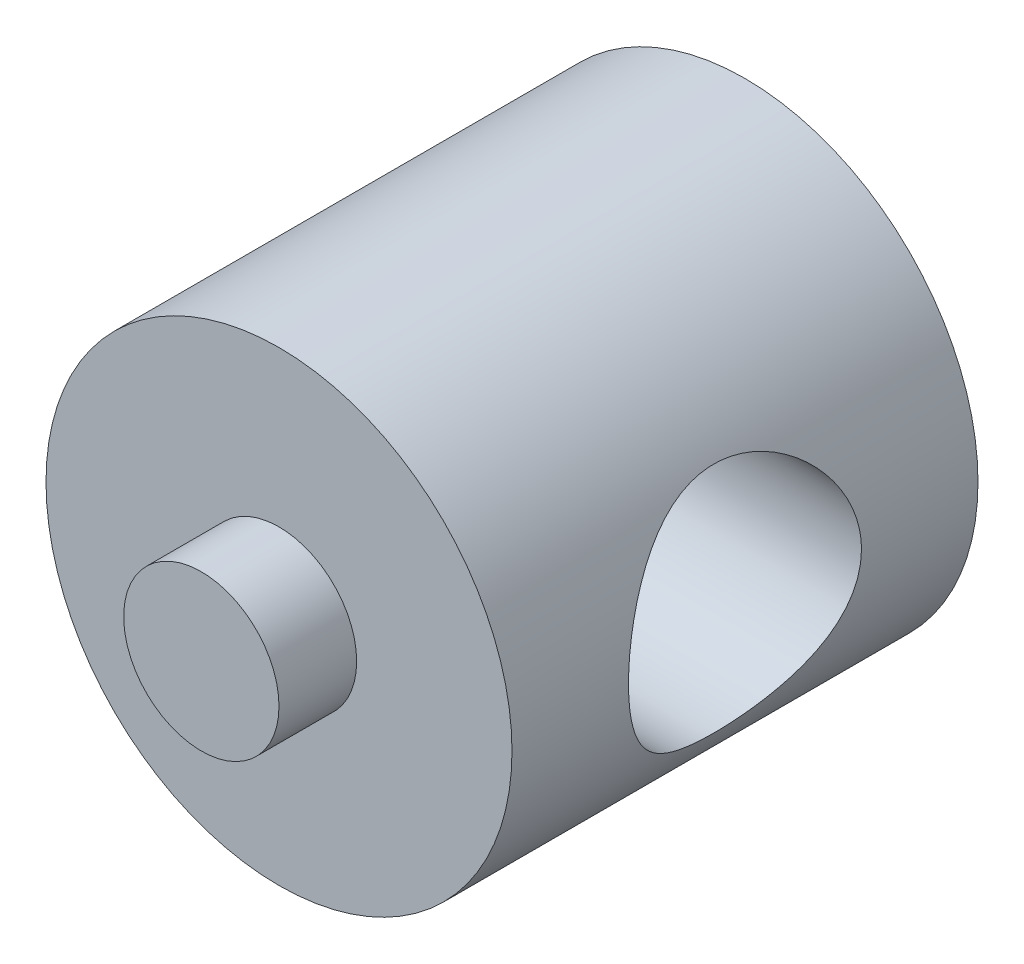
ISO-10303-21;
HEADER;
FILE_DESCRIPTION(('STEP AP214'),'2;1');
FILE_NAME('part.step','',(''),(''),'','','');
FILE_SCHEMA(('AUTOMOTIVE_DESIGN { 1 0 10303 214 1 1 1 1 }'));
ENDSEC;
DATA;
#1=APPLICATION_CONTEXT('core data for automotive mechanical design processes');
#2=APPLICATION_PROTOCOL_DEFINITION('international standard','automotive_design',2000,#1);
#3=PRODUCT_CONTEXT('',#1,'mechanical');
#4=PRODUCT('Part','Part','',(#3));
#5=PRODUCT_RELATED_PRODUCT_CATEGORY('part','',(#4));
#6=PRODUCT_DEFINITION_FORMATION('','',#4);
#7=PRODUCT_DEFINITION_CONTEXT('part definition',#1,'design');
#8=PRODUCT_DEFINITION('design','',#6,#7);
#9=PRODUCT_DEFINITION_SHAPE('','',#8);
#10=(LENGTH_UNIT() NAMED_UNIT(*) SI_UNIT(.MILLI.,.METRE.));
#11=(NAMED_UNIT(*) PLANE_ANGLE_UNIT() SI_UNIT($,.RADIAN.));
#12=(NAMED_UNIT(*) SI_UNIT($,.STERADIAN.) SOLID_ANGLE_UNIT());
#13=UNCERTAINTY_MEASURE_WITH_UNIT(LENGTH_MEASURE(1.E-05),#10,'distance_accuracy_value','');
#14=(GEOMETRIC_REPRESENTATION_CONTEXT(3) GLOBAL_UNCERTAINTY_ASSIGNED_CONTEXT((#13)) GLOBAL_UNIT_ASSIGNED_CONTEXT((#10,
#11,#12)) REPRESENTATION_CONTEXT('',''));
#15=CARTESIAN_POINT('',(0.,0.,0.));
#16=DIRECTION('',(0.,0.,1.));
#17=DIRECTION('',(1.,0.,0.));
#18=AXIS2_PLACEMENT_3D('',#15,#16,#17);
#19=CARTESIAN_POINT('',(0.,0.,9.525));
#20=DIRECTION('',(0.,0.,-1.));
#21=DIRECTION('',(-1.,0.,0.));
#22=AXIS2_PLACEMENT_3D('',#19,#20,#21);
#23=CYLINDRICAL_SURFACE('',#22,9.525);
#24=CARTESIAN_POINT('',(-9.525,0.,-4.7625));
#25=CARTESIAN_POINT('',(-9.5249996206372,0.125243167799989,-4.76249958831423));
#26=CARTESIAN_POINT('',(-9.52252400598023,0.250495089131835,-4.75755388154092));
#27=CARTESIAN_POINT('',(-9.51268396387997,0.500076393496525,-4.73782749335829));
#28=CARTESIAN_POINT('',(-9.50531740964971,0.624405351393145,-4.72304253341983));
#29=CARTESIAN_POINT('',(-9.48587193787975,0.871331001268147,-4.68378465754782));
#30=CARTESIAN_POINT('',(-9.47378630044847,0.993924963523297,-4.65929792572799));
#31=CARTESIAN_POINT('',(-9.44520637539277,1.23637011508467,-4.60090773438337));
#32=CARTESIAN_POINT('',(-9.42871028557932,1.35622016139572,-4.56700042522137));
#33=CARTESIAN_POINT('',(-9.39179697222459,1.59183120722171,-4.49029599546492));
#34=CARTESIAN_POINT('',(-9.37139708461428,1.70760770137533,-4.44753811225714));
#35=CARTESIAN_POINT('',(-9.3271126718355,1.93495086483045,-4.35345002008972));
#36=CARTESIAN_POINT('',(-9.30322683559748,2.04651593025,-4.30211658479887));
#37=CARTESIAN_POINT('',(-9.22716144615755,2.37384489745524,-4.13594585342937));
#38=CARTESIAN_POINT('',(-9.17053150857179,2.58250225923313,-4.00885268845467));
#39=CARTESIAN_POINT('',(-9.04666081910159,2.9885453858336,-3.7170309696508));
#40=CARTESIAN_POINT('',(-8.97898540114139,3.18448556312959,-3.55049071765087));
#41=CARTESIAN_POINT('',(-8.84205954293001,3.5469969745544,-3.18840889326789));
#42=CARTESIAN_POINT('',(-8.77280794740667,3.71354582861883,-2.99284542792684));
#43=CARTESIAN_POINT('',(-8.63435408613187,4.02553537328567,-2.5598674226152));
#44=CARTESIAN_POINT('',(-8.56557212539103,4.16833749963762,-2.32038345074362));
#45=CARTESIAN_POINT('',(-8.47379640254792,4.35029005345507,-1.94317806162735));
#46=CARTESIAN_POINT('',(-8.44509626519091,4.40557901885787,-1.81439982504697));
#47=CARTESIAN_POINT('',(-8.39256904955604,4.50483773649694,-1.55162131087768));
#48=CARTESIAN_POINT('',(-8.36873908777994,4.54881419057647,-1.4176241795386));
#49=CARTESIAN_POINT('',(-8.32818911059645,4.62261399582858,-1.15348439070287));
#50=CARTESIAN_POINT('',(-8.31113119648639,4.65312214328153,-1.0235845780924));
#51=CARTESIAN_POINT('',(-8.28290506375683,4.7031837839128,-0.76111831285817));
#52=CARTESIAN_POINT('',(-8.27173372047612,4.72274308921002,-0.62855331382261));
#53=CARTESIAN_POINT('',(-8.25575723957705,4.75061653464239,-0.36194274554475));
#54=CARTESIAN_POINT('',(-8.25094826797976,4.75893744712047,-0.227898117086417));
#55=CARTESIAN_POINT('',(-8.24790017307781,4.76421854927812,0.0404818193190367));
#56=CARTESIAN_POINT('',(-8.24966042295241,4.76117982286953,0.174817098310511));
#57=CARTESIAN_POINT('',(-8.25906842780931,4.74483797280581,0.426439463053397));
#58=CARTESIAN_POINT('',(-8.26598467895691,4.73280973448218,0.543838732731229));
#59=CARTESIAN_POINT('',(-8.28459407928507,4.7001560114978,0.777063325744908));
#60=CARTESIAN_POINT('',(-8.29628872876442,4.67952782662532,0.89288814292927));
#61=CARTESIAN_POINT('',(-8.33800444414718,4.60506661909892,1.23679640510272));
#62=CARTESIAN_POINT('',(-8.37466460391199,4.5386452957775,1.46148677858525));
#63=CARTESIAN_POINT('',(-8.46236620531704,4.37297035741612,1.90136422745735));
#64=CARTESIAN_POINT('',(-8.51372273880604,4.27298801966147,2.11620803502557));
#65=CARTESIAN_POINT('',(-8.62505005190895,4.04355977442936,2.52713750391294));
#66=CARTESIAN_POINT('',(-8.68502469635285,3.91410063264098,2.72321468317278));
#67=CARTESIAN_POINT('',(-8.8160120789406,3.61029947812718,3.11715493103464));
#68=CARTESIAN_POINT('',(-8.88746017331488,3.43234782914613,3.31209202014425));
#69=CARTESIAN_POINT('',(-9.02721381532401,3.04584295330871,3.67064878147008));
#70=CARTESIAN_POINT('',(-9.0955178493011,2.83727518509305,3.83425348656057));
#71=CARTESIAN_POINT('',(-9.19195370403877,2.49965137796343,4.05616532663717));
#72=CARTESIAN_POINT('',(-9.22372787983903,2.38002127368373,4.12751797031745));
#73=CARTESIAN_POINT('',(-9.28366556941997,2.13427687141611,4.25977821368204));
#74=CARTESIAN_POINT('',(-9.31183060399966,2.00816533613017,4.32069021646027));
#75=CARTESIAN_POINT('',(-9.36371844925579,1.75034069526616,4.43140995548221));
#76=CARTESIAN_POINT('',(-9.38744304755807,1.61862987016266,4.48122216181515));
#77=CARTESIAN_POINT('',(-9.42974072645533,1.35056106639509,4.56916623782169));
#78=CARTESIAN_POINT('',(-9.4483143996453,1.21420362433566,4.60729945117316));
#79=CARTESIAN_POINT('',(-9.47841891468132,0.949450109300047,4.66871072091767));
#80=CARTESIAN_POINT('',(-9.49040564136936,0.821329961906901,4.69295751387122));
#81=CARTESIAN_POINT('',(-9.50921741531494,0.563164063018347,4.73088465881512));
#82=CARTESIAN_POINT('',(-9.51604291885924,0.433118482780759,4.74456594486943));
#83=CARTESIAN_POINT('',(-9.52433687415141,0.172222200636558,4.76117903695803));
#84=CARTESIAN_POINT('',(-9.52580737679104,0.0413718261918288,4.76411495832146));
#85=CARTESIAN_POINT('',(-9.52335444060485,-0.220072847166308,4.75920856581017));
#86=CARTESIAN_POINT('',(-9.51943124049279,-0.350667157156418,4.75136672893597));
#87=CARTESIAN_POINT('',(-9.50681651861088,-0.600383632816324,4.72603956317407));
#88=CARTESIAN_POINT('',(-9.49851975936574,-0.71960779805965,4.70935204534436));
#89=CARTESIAN_POINT('',(-9.47763434053446,-0.956123558476324,4.66708381392194));
#90=CARTESIAN_POINT('',(-9.46504432155854,-1.07341452918894,4.64150028350313));
#91=CARTESIAN_POINT('',(-9.43586934009923,-1.30523272581462,4.58171294409776));
#92=CARTESIAN_POINT('',(-9.41928560017321,-1.41976078572846,4.54751177299423));
#93=CARTESIAN_POINT('',(-9.382499981618,-1.64542419391326,4.47081767633952));
#94=CARTESIAN_POINT('',(-9.36229671724176,-1.75655822362735,4.42832157448654));
#95=CARTESIAN_POINT('',(-9.29566539786795,-2.09007412634844,4.2862997139752));
#96=CARTESIAN_POINT('',(-9.24405921515466,-2.3061103310862,4.17391144344975));
#97=CARTESIAN_POINT('',(-9.13180205397676,-2.7168591855057,3.91901153595821));
#98=CARTESIAN_POINT('',(-9.07114722574502,-2.91156269769227,3.77648706665232));
#99=CARTESIAN_POINT('',(-8.93960783885979,-3.29452731372962,3.44920510528762));
#100=CARTESIAN_POINT('',(-8.868303631423,-3.48027815582499,3.26167471385581));
#101=CARTESIAN_POINT('',(-8.72786114875584,-3.81886460963264,2.85781381337991));
#102=CARTESIAN_POINT('',(-8.65872439991558,-3.97167745144758,2.64146354739159));
#103=CARTESIAN_POINT('',(-8.56092960704944,-4.17638881115549,2.29315273566664));
#104=CARTESIAN_POINT('',(-8.52864647367417,-4.24173741059432,2.16993704199734));
#105=CARTESIAN_POINT('',(-8.46793790675362,-4.36167001930206,1.91748336900804));
#106=CARTESIAN_POINT('',(-8.43951072775552,-4.41625890421415,1.78824815034194));
#107=CARTESIAN_POINT('',(-8.38762286815761,-4.51403084118841,1.52468862385271));
#108=CARTESIAN_POINT('',(-8.36415813189979,-4.55722321448887,1.39036857839809));
#109=CARTESIAN_POINT('',(-8.32316235190995,-4.63167416627274,1.11757678170936));
#110=CARTESIAN_POINT('',(-8.30563038948562,-4.66293459251874,0.979105676886768));
#111=CARTESIAN_POINT('',(-8.27866590076996,-4.71062527640278,0.71269385508765));
#112=CARTESIAN_POINT('',(-8.26861751501085,-4.72819092555356,0.585017991328247));
#113=CARTESIAN_POINT('',(-8.25443000373948,-4.75291664228841,0.328340803473246));
#114=CARTESIAN_POINT('',(-8.25029025909993,-4.76007780009145,0.199339619676062));
#115=CARTESIAN_POINT('',(-8.24809207938036,-4.7638856717754,-0.0588234710669067));
#116=CARTESIAN_POINT('',(-8.25003150672727,-4.76053608147038,-0.187985305559261));
#117=CARTESIAN_POINT('',(-8.2599055190099,-4.74338307929259,-0.445375243945349));
#118=CARTESIAN_POINT('',(-8.26783985851659,-4.72958009537705,-0.573603385847067));
#119=CARTESIAN_POINT('',(-8.28834856879423,-4.69353669139923,-0.815873592556456));
#120=CARTESIAN_POINT('',(-8.30040666790683,-4.67222934629288,-0.930099638041787));
#121=CARTESIAN_POINT('',(-8.32877048505192,-4.62147643847892,-1.15620278401551));
#122=CARTESIAN_POINT('',(-8.34507751652014,-4.59202835912458,-1.26807914659067));
#123=CARTESIAN_POINT('',(-8.3996615585496,-4.49189766535446,-1.59916855214504));
#124=CARTESIAN_POINT('',(-8.44361545117001,-4.40940547807408,-1.81399443047416));
#125=CARTESIAN_POINT('',(-8.54528603634261,-4.20916574352957,-2.24138522605267));
#126=CARTESIAN_POINT('',(-8.60372898549138,-4.08942191082135,-2.45282854237986));
#127=CARTESIAN_POINT('',(-8.72658246261697,-3.82024338512734,-2.85403681438992));
#128=CARTESIAN_POINT('',(-8.79099608593484,-3.67079324521365,-3.04379041048057));
#129=CARTESIAN_POINT('',(-8.92789150982252,-3.32520368388597,-3.42014923519336));
#130=CARTESIAN_POINT('',(-9.00040265167881,-3.12559766366325,-3.60357040787616));
#131=CARTESIAN_POINT('',(-9.13818513010387,-2.69626914168462,-3.93509603617707));
#132=CARTESIAN_POINT('',(-9.20345255422175,-2.4665305095516,-4.08318145555075));
#133=CARTESIAN_POINT('',(-9.29086610240478,-2.10268072495818,-4.2754204698368));
#134=CARTESIAN_POINT('',(-9.3183476000623,-1.97763300723182,-4.33470089313457));
#135=CARTESIAN_POINT('',(-9.36893044835914,-1.72211552262133,-4.44239918870466));
#136=CARTESIAN_POINT('',(-9.39203394996841,-1.59164845695406,-4.49082239743041));
#137=CARTESIAN_POINT('',(-9.43312646132604,-1.32654199767925,-4.57613903004475));
#138=CARTESIAN_POINT('',(-9.45112661821364,-1.19191242135595,-4.6130576010708));
#139=CARTESIAN_POINT('',(-9.48151473751691,-0.919388438520266,-4.67500106044581));
#140=CARTESIAN_POINT('',(-9.49390612793916,-0.781496080561074,-4.700033214082));
#141=CARTESIAN_POINT('',(-9.51048759454479,-0.536297175823771,-4.73342449172891));
#142=CARTESIAN_POINT('',(-9.51592021375587,-0.429411583767847,-4.74431844539165));
#143=CARTESIAN_POINT('',(-9.52317662911679,-0.215019489362876,-4.75885647628327));
#144=CARTESIAN_POINT('',(-9.52500032565785,-0.107512969957933,-4.76250035340499));
#145=CARTESIAN_POINT('',(-9.525,0.,-4.7625));
#146=B_SPLINE_CURVE_WITH_KNOTS('',3,(#24,#25,#26,#27,#28,#29,#30,#31,#32,#33,#34,#35,#36,#37,
#38,#39,#40,#41,#42,#43,#44,#45,#46,#47,#48,#49,#50,#51,#52,#53,#54,#55,#56,#57,#58,#59,#60,#61,
#62,#63,#64,#65,#66,#67,#68,#69,#70,#71,#72,#73,#74,#75,#76,#77,#78,#79,#80,#81,#82,#83,#84,#85,
#86,#87,#88,#89,#90,#91,#92,#93,#94,#95,#96,#97,#98,#99,#100,#101,#102,#103,#104,#105,#106,#107,
#108,#109,#110,#111,#112,#113,#114,#115,#116,#117,#118,#119,#120,#121,#122,#123,#124,#125,#126,
#127,#128,#129,#130,#131,#132,#133,#134,#135,#136,#137,#138,#139,#140,#141,#142,#143,#144,#145),
.UNSPECIFIED.,.T.,.F.,(4,2,2,2,2,2,2,2,2,2,2,2,2,2,2,2,2,2,2,2,2,2,2,2,2,2,2,2,2,2,2,2,2,2,2,2,
2,2,2,2,2,2,2,2,2,2,2,2,2,2,2,2,2,2,2,2,2,2,2,2,4),(0.,0.37562341815402,0.751410280296021,
1.12773421934005,1.50421216665562,1.87905550525341,2.25404018794787,3.00318908218551,
3.79765979831069,4.59273287924314,5.44946389368039,5.8781190538996,6.30651967909288,
6.70950847539314,7.11228314445236,7.51481498990845,7.91730842763879,8.27152461989833,
8.62585211283934,9.33399259637595,10.0586277474397,10.7835888844336,11.6004728904415,
12.4177461446779,12.8458801890468,13.2738332313566,13.701613616489,14.1293447666274,
14.521651524315,14.913923595397,15.3060454158579,15.698149882404,16.0597456619957,
16.4214560413944,16.7830558344937,17.144794364286,17.8882174899416,18.6319578135026,
19.4487341785404,20.2660733794108,20.6950689367829,21.1238696504806,21.5523185520335,
21.9807010777177,22.3679690015927,22.7551963432537,23.1422875423821,23.5293628950278,
23.8794231642634,24.2295917732494,24.9294696536929,25.6763690993088,26.4236579446131,
27.2617475314397,28.1002876036314,28.5230685284025,28.9456411934233,29.3672836019069,
29.7886679587935,30.1111069020891,30.4335547448008),.UNSPECIFIED.);
#147=CARTESIAN_POINT('',(-9.525,0.,-4.7625));
#148=VERTEX_POINT('',#147);
#149=EDGE_CURVE('E10',#148,#148,#146,.T.);
#150=ORIENTED_EDGE('',*,*,#149,.T.);
#151=EDGE_LOOP('',(#150));
#152=FACE_BOUND('',#151,.T.);
#153=CARTESIAN_POINT('',(9.52499999999999,0.,-4.7625));
#154=CARTESIAN_POINT('',(9.5249996206372,-0.125243167799989,-4.76249958831423));
#155=CARTESIAN_POINT('',(9.52252400598023,-0.250495089131836,-4.75755388154092));
#156=CARTESIAN_POINT('',(9.51268396387997,-0.500076393496527,-4.73782749335829));
#157=CARTESIAN_POINT('',(9.50531740964972,-0.624405351393147,-4.72304253341983));
#158=CARTESIAN_POINT('',(9.48587193787975,-0.871331001268149,-4.68378465754782));
#159=CARTESIAN_POINT('',(9.47378630044847,-0.993924963523299,-4.65929792572799));
#160=CARTESIAN_POINT('',(9.44520637539277,-1.23637011508467,-4.60090773438337));
#161=CARTESIAN_POINT('',(9.42871028557932,-1.35622016139572,-4.56700042522137));
#162=CARTESIAN_POINT('',(9.39179697222459,-1.59183120722171,-4.49029599546492));
#163=CARTESIAN_POINT('',(9.37139708461428,-1.70760770137533,-4.44753811225714));
#164=CARTESIAN_POINT('',(9.3271126718355,-1.93495086483046,-4.35345002008972));
#165=CARTESIAN_POINT('',(9.30322683559748,-2.04651593025,-4.30211658479887));
#166=CARTESIAN_POINT('',(9.22716144615755,-2.37384489745524,-4.13594585342936));
#167=CARTESIAN_POINT('',(9.17053150857179,-2.58250225923314,-4.00885268845467));
#168=CARTESIAN_POINT('',(9.04666081910159,-2.98854538583361,-3.7170309696508));
#169=CARTESIAN_POINT('',(8.97898540114139,-3.18448556312959,-3.55049071765087));
#170=CARTESIAN_POINT('',(8.84205954293001,-3.5469969745544,-3.18840889326789));
#171=CARTESIAN_POINT('',(8.77280794740667,-3.71354582861884,-2.99284542792683));
#172=CARTESIAN_POINT('',(8.63435408613186,-4.02553537328567,-2.5598674226152));
#173=CARTESIAN_POINT('',(8.56557212539103,-4.16833749963762,-2.32038345074362));
#174=CARTESIAN_POINT('',(8.47379640254792,-4.35029005345508,-1.94317806162735));
#175=CARTESIAN_POINT('',(8.44509626519091,-4.40557901885787,-1.81439982504697));
#176=CARTESIAN_POINT('',(8.39256904955604,-4.50483773649694,-1.55162131087767));
#177=CARTESIAN_POINT('',(8.36873908777994,-4.54881419057647,-1.41762417953859));
#178=CARTESIAN_POINT('',(8.32818911059645,-4.62261399582858,-1.15348439070287));
#179=CARTESIAN_POINT('',(8.31113119648639,-4.65312214328153,-1.0235845780924));
#180=CARTESIAN_POINT('',(8.28290506375683,-4.70318378391281,-0.761118312858166));
#181=CARTESIAN_POINT('',(8.27173372047612,-4.72274308921002,-0.628553313822606));
#182=CARTESIAN_POINT('',(8.25575723957705,-4.75061653464239,-0.361942745544747));
#183=CARTESIAN_POINT('',(8.25094826797976,-4.75893744712047,-0.227898117086414));
#184=CARTESIAN_POINT('',(8.24790017307781,-4.76421854927812,0.0404818193190395));
#185=CARTESIAN_POINT('',(8.24966042295241,-4.76117982286953,0.174817098310513));
#186=CARTESIAN_POINT('',(8.25906842780931,-4.74483797280581,0.4264394630534));
#187=CARTESIAN_POINT('',(8.26598467895691,-4.73280973448218,0.543838732731232));
#188=CARTESIAN_POINT('',(8.28459407928507,-4.7001560114978,0.77706332574491));
#189=CARTESIAN_POINT('',(8.29628872876443,-4.67952782662532,0.892888142929271));
#190=CARTESIAN_POINT('',(8.33800444414718,-4.60506661909892,1.23679640510272));
#191=CARTESIAN_POINT('',(8.374664603912,-4.5386452957775,1.46148677858525));
#192=CARTESIAN_POINT('',(8.46236620531704,-4.37297035741612,1.90136422745735));
#193=CARTESIAN_POINT('',(8.51372273880604,-4.27298801966147,2.11620803502557));
#194=CARTESIAN_POINT('',(8.62505005190895,-4.04355977442936,2.52713750391294));
#195=CARTESIAN_POINT('',(8.68502469635285,-3.91410063264098,2.72321468317278));
#196=CARTESIAN_POINT('',(8.8160120789406,-3.61029947812718,3.11715493103464));
#197=CARTESIAN_POINT('',(8.88746017331488,-3.43234782914613,3.31209202014425));
#198=CARTESIAN_POINT('',(9.02721381532401,-3.04584295330871,3.67064878147008));
#199=CARTESIAN_POINT('',(9.0955178493011,-2.83727518509305,3.83425348656057));
#200=CARTESIAN_POINT('',(9.19195370403877,-2.49965137796343,4.05616532663717));
#201=CARTESIAN_POINT('',(9.22372787983903,-2.38002127368373,4.12751797031745));
#202=CARTESIAN_POINT('',(9.28366556941997,-2.13427687141611,4.25977821368204));
#203=CARTESIAN_POINT('',(9.31183060399966,-2.00816533613017,4.32069021646027));
#204=CARTESIAN_POINT('',(9.36371844925579,-1.75034069526615,4.43140995548221));
#205=CARTESIAN_POINT('',(9.38744304755807,-1.61862987016266,4.48122216181516));
#206=CARTESIAN_POINT('',(9.42974072645533,-1.35056106639509,4.56916623782169));
#207=CARTESIAN_POINT('',(9.4483143996453,-1.21420362433566,4.60729945117316));
#208=CARTESIAN_POINT('',(9.47841891468132,-0.949450109300047,4.66871072091767));
#209=CARTESIAN_POINT('',(9.49040564136936,-0.8213299619069,4.69295751387122));
#210=CARTESIAN_POINT('',(9.50921741531494,-0.563164063018346,4.73088465881512));
#211=CARTESIAN_POINT('',(9.51604291885924,-0.433118482780757,4.74456594486943));
#212=CARTESIAN_POINT('',(9.52433687415141,-0.172222200636556,4.76117903695803));
#213=CARTESIAN_POINT('',(9.52580737679104,-0.0413718261918264,4.76411495832146));
#214=CARTESIAN_POINT('',(9.52335444060485,0.22007284716631,4.75920856581017));
#215=CARTESIAN_POINT('',(9.51943124049279,0.35066715715642,4.75136672893597));
#216=CARTESIAN_POINT('',(9.50681651861088,0.600383632816326,4.72603956317407));
#217=CARTESIAN_POINT('',(9.49851975936574,0.719607798059654,4.70935204534436));
#218=CARTESIAN_POINT('',(9.47763434053446,0.956123558476328,4.66708381392194));
#219=CARTESIAN_POINT('',(9.46504432155854,1.07341452918895,4.64150028350313));
#220=CARTESIAN_POINT('',(9.43586934009923,1.30523272581463,4.58171294409775));
#221=CARTESIAN_POINT('',(9.41928560017321,1.41976078572846,4.54751177299423));
#222=CARTESIAN_POINT('',(9.382499981618,1.64542419391326,4.47081767633952));
#223=CARTESIAN_POINT('',(9.36229671724176,1.75655822362735,4.42832157448654));
#224=CARTESIAN_POINT('',(9.29566539786795,2.09007412634845,4.2862997139752));
#225=CARTESIAN_POINT('',(9.24405921515466,2.3061103310862,4.17391144344975));
#226=CARTESIAN_POINT('',(9.13180205397676,2.71685918550571,3.91901153595821));
#227=CARTESIAN_POINT('',(9.07114722574502,2.91156269769227,3.77648706665231));
#228=CARTESIAN_POINT('',(8.93960783885979,3.29452731372962,3.44920510528762));
#229=CARTESIAN_POINT('',(8.868303631423,3.48027815582499,3.26167471385581));
#230=CARTESIAN_POINT('',(8.72786114875584,3.81886460963264,2.85781381337991));
#231=CARTESIAN_POINT('',(8.65872439991558,3.97167745144758,2.64146354739159));
#232=CARTESIAN_POINT('',(8.56092960704944,4.17638881115549,2.29315273566663));
#233=CARTESIAN_POINT('',(8.52864647367417,4.24173741059432,2.16993704199734));
#234=CARTESIAN_POINT('',(8.46793790675362,4.36167001930206,1.91748336900803));
#235=CARTESIAN_POINT('',(8.43951072775552,4.41625890421415,1.78824815034193));
#236=CARTESIAN_POINT('',(8.3876228681576,4.51403084118841,1.52468862385271));
#237=CARTESIAN_POINT('',(8.36415813189979,4.55722321448887,1.39036857839808));
#238=CARTESIAN_POINT('',(8.32316235190995,4.63167416627274,1.11757678170936));
#239=CARTESIAN_POINT('',(8.30563038948562,4.66293459251874,0.979105676886764));
#240=CARTESIAN_POINT('',(8.27866590076996,4.71062527640278,0.712693855087645));
#241=CARTESIAN_POINT('',(8.26861751501085,4.72819092555356,0.585017991328243));
#242=CARTESIAN_POINT('',(8.25443000373948,4.75291664228841,0.328340803473241));
#243=CARTESIAN_POINT('',(8.25029025909993,4.76007780009145,0.199339619676057));
#244=CARTESIAN_POINT('',(8.24809207938036,4.7638856717754,-0.0588234710669095));
#245=CARTESIAN_POINT('',(8.25003150672727,4.76053608147038,-0.187985305559263));
#246=CARTESIAN_POINT('',(8.2599055190099,4.74338307929259,-0.44537524394535));
#247=CARTESIAN_POINT('',(8.26783985851659,4.72958009537705,-0.573603385847069));
#248=CARTESIAN_POINT('',(8.28834856879423,4.69353669139923,-0.815873592556459));
#249=CARTESIAN_POINT('',(8.30040666790683,4.67222934629288,-0.93009963804179));
#250=CARTESIAN_POINT('',(8.32877048505192,4.62147643847892,-1.15620278401552));
#251=CARTESIAN_POINT('',(8.34507751652014,4.59202835912458,-1.26807914659067));
#252=CARTESIAN_POINT('',(8.3996615585496,4.49189766535446,-1.59916855214504));
#253=CARTESIAN_POINT('',(8.44361545117001,4.40940547807408,-1.81399443047417));
#254=CARTESIAN_POINT('',(8.54528603634261,4.20916574352957,-2.24138522605267));
#255=CARTESIAN_POINT('',(8.60372898549138,4.08942191082135,-2.45282854237986));
#256=CARTESIAN_POINT('',(8.72658246261697,3.82024338512734,-2.85403681438992));
#257=CARTESIAN_POINT('',(8.79099608593484,3.67079324521365,-3.04379041048057));
#258=CARTESIAN_POINT('',(8.92789150982252,3.32520368388597,-3.42014923519336));
#259=CARTESIAN_POINT('',(9.00040265167881,3.12559766366325,-3.60357040787616));
#260=CARTESIAN_POINT('',(9.13818513010387,2.69626914168462,-3.93509603617707));
#261=CARTESIAN_POINT('',(9.20345255422175,2.4665305095516,-4.08318145555075));
#262=CARTESIAN_POINT('',(9.29086610240478,2.10268072495818,-4.2754204698368));
#263=CARTESIAN_POINT('',(9.31834760006229,1.97763300723182,-4.33470089313457));
#264=CARTESIAN_POINT('',(9.36893044835914,1.72211552262134,-4.44239918870466));
#265=CARTESIAN_POINT('',(9.39203394996841,1.59164845695407,-4.49082239743041));
#266=CARTESIAN_POINT('',(9.43312646132604,1.32654199767925,-4.57613903004475));
#267=CARTESIAN_POINT('',(9.45112661821365,1.19191242135595,-4.6130576010708));
#268=CARTESIAN_POINT('',(9.48151473751691,0.919388438520268,-4.67500106044581));
#269=CARTESIAN_POINT('',(9.49390612793916,0.781496080561074,-4.700033214082));
#270=CARTESIAN_POINT('',(9.51048759454479,0.53629717582377,-4.73342449172891));
#271=CARTESIAN_POINT('',(9.51592021375587,0.429411583767847,-4.74431844539165));
#272=CARTESIAN_POINT('',(9.52317662911679,0.215019489362877,-4.75885647628327));
#273=CARTESIAN_POINT('',(9.52500032565784,0.107512969957933,-4.76250035340498));
#274=CARTESIAN_POINT('',(9.52499999999999,0.,-4.7625));
#275=B_SPLINE_CURVE_WITH_KNOTS('',3,(#153,#154,#155,#156,#157,#158,#159,#160,#161,#162,#163,
#164,#165,#166,#167,#168,#169,#170,#171,#172,#173,#174,#175,#176,#177,#178,#179,#180,#181,#182,
#183,#184,#185,#186,#187,#188,#189,#190,#191,#192,#193,#194,#195,#196,#197,#198,#199,#200,#201,
#202,#203,#204,#205,#206,#207,#208,#209,#210,#211,#212,#213,#214,#215,#216,#217,#218,#219,#220,
#221,#222,#223,#224,#225,#226,#227,#228,#229,#230,#231,#232,#233,#234,#235,#236,#237,#238,#239,
#240,#241,#242,#243,#244,#245,#246,#247,#248,#249,#250,#251,#252,#253,#254,#255,#256,#257,#258,
#259,#260,#261,#262,#263,#264,#265,#266,#267,#268,#269,#270,#271,#272,#273,#274),.UNSPECIFIED.,
.T.,.F.,(4,2,2,2,2,2,2,2,2,2,2,2,2,2,2,2,2,2,2,2,2,2,2,2,2,2,2,2,2,2,2,2,2,2,2,2,2,2,2,2,2,2,2,
2,2,2,2,2,2,2,2,2,2,2,2,2,2,2,2,2,4),(0.,0.375623418154021,0.751410280296022,1.12773421934006,
1.50421216665563,1.87905550525341,2.25404018794787,3.00318908218551,3.7976597983107,
4.59273287924314,5.4494638936804,5.8781190538996,6.30651967909289,6.70950847539315,
7.11228314445237,7.51481498990845,7.91730842763879,8.27152461989833,8.62585211283934,
9.33399259637595,10.0586277474397,10.7835888844336,11.6004728904415,12.4177461446779,
12.8458801890468,13.2738332313566,13.701613616489,14.1293447666274,14.521651524315,
14.913923595397,15.3060454158579,15.698149882404,16.0597456619957,16.4214560413944,
16.7830558344937,17.144794364286,17.8882174899416,18.6319578135026,19.4487341785404,
20.2660733794108,20.6950689367829,21.1238696504806,21.5523185520335,21.9807010777177,
22.3679690015927,22.7551963432537,23.1422875423821,23.5293628950278,23.8794231642634,
24.2295917732494,24.9294696536929,25.6763690993088,26.423657944613,27.2617475314397,
28.1002876036314,28.5230685284024,28.9456411934233,29.3672836019069,29.7886679587935,
30.1111069020891,30.4335547448008),.UNSPECIFIED.);
#276=CARTESIAN_POINT('',(9.52499999999999,0.,-4.7625));
#277=VERTEX_POINT('',#276);
#278=EDGE_CURVE('E45',#277,#277,#275,.T.);
#279=ORIENTED_EDGE('',*,*,#278,.T.);
#280=EDGE_LOOP('',(#279));
#281=FACE_BOUND('',#280,.T.);
#282=CARTESIAN_POINT('',(0.,0.,9.525));
#283=DIRECTION('',(0.,0.,1.));
#284=DIRECTION('',(1.,0.,0.));
#285=AXIS2_PLACEMENT_3D('',#282,#283,#284);
#286=CIRCLE('',#285,9.525);
#287=CARTESIAN_POINT('',(9.525,0.,9.525));
#288=VERTEX_POINT('',#287);
#289=EDGE_CURVE('E53',#288,#288,#286,.T.);
#290=ORIENTED_EDGE('',*,*,#289,.F.);
#291=EDGE_LOOP('',(#290));
#292=FACE_BOUND('',#291,.T.);
#293=CARTESIAN_POINT('',(0.,0.,-9.525));
#294=DIRECTION('',(0.,0.,1.));
#295=DIRECTION('',(1.,0.,0.));
#296=AXIS2_PLACEMENT_3D('',#293,#294,#295);
#297=CIRCLE('',#296,9.525);
#298=CARTESIAN_POINT('',(9.525,0.,-9.525));
#299=VERTEX_POINT('',#298);
#300=EDGE_CURVE('E97',#299,#299,#297,.T.);
#301=ORIENTED_EDGE('',*,*,#300,.T.);
#302=EDGE_LOOP('',(#301));
#303=FACE_BOUND('',#302,.T.);
#304=ADVANCED_FACE('F34',(#152,#281,#292,#303),#23,.T.);
#305=CARTESIAN_POINT('',(0.,0.,9.525));
#306=DIRECTION('',(0.,0.,1.));
#307=DIRECTION('',(1.,0.,0.));
#308=AXIS2_PLACEMENT_3D('',#305,#306,#307);
#309=PLANE('',#308);
#310=CARTESIAN_POINT('',(0.,0.,9.525));
#311=DIRECTION('',(0.,0.,1.));
#312=DIRECTION('',(1.,0.,0.));
#313=AXIS2_PLACEMENT_3D('',#310,#311,#312);
#314=CIRCLE('',#313,3.175);
#315=CARTESIAN_POINT('',(3.175,0.,9.525));
#316=VERTEX_POINT('',#315);
#317=EDGE_CURVE('E98',#316,#316,#314,.F.);
#318=ORIENTED_EDGE('',*,*,#317,.T.);
#319=EDGE_LOOP('',(#318));
#320=FACE_BOUND('',#319,.T.);
#321=ORIENTED_EDGE('',*,*,#289,.T.);
#322=EDGE_LOOP('',(#321));
#323=FACE_BOUND('',#322,.T.);
#324=ADVANCED_FACE('F79',(#320,#323),#309,.T.);
#325=CARTESIAN_POINT('',(0.,0.,-9.525));
#326=DIRECTION('',(0.,0.,1.));
#327=DIRECTION('',(1.,0.,0.));
#328=AXIS2_PLACEMENT_3D('',#325,#326,#327);
#329=PLANE('',#328);
#330=CARTESIAN_POINT('',(0.,0.,-9.525));
#331=DIRECTION('',(0.,0.,1.));
#332=DIRECTION('',(1.,0.,0.));
#333=AXIS2_PLACEMENT_3D('',#330,#331,#332);
#334=CIRCLE('',#333,3.175);
#335=CARTESIAN_POINT('',(3.175,0.,-9.525));
#336=VERTEX_POINT('',#335);
#337=EDGE_CURVE('E49',#336,#336,#334,.F.);
#338=ORIENTED_EDGE('',*,*,#337,.F.);
#339=EDGE_LOOP('',(#338));
#340=FACE_BOUND('',#339,.T.);
#341=ORIENTED_EDGE('',*,*,#300,.F.);
#342=EDGE_LOOP('',(#341));
#343=FACE_BOUND('',#342,.T.);
#344=ADVANCED_FACE('F74',(#340,#343),#329,.F.);
#345=CARTESIAN_POINT('',(0.,0.,-12.7));
#346=DIRECTION('',(0.,0.,1.));
#347=DIRECTION('',(1.,0.,0.));
#348=AXIS2_PLACEMENT_3D('',#345,#346,#347);
#349=PLANE('',#348);
#350=CARTESIAN_POINT('',(0.,0.,-12.7));
#351=DIRECTION('',(0.,0.,1.));
#352=DIRECTION('',(1.,0.,0.));
#353=AXIS2_PLACEMENT_3D('',#350,#351,#352);
#354=CIRCLE('',#353,3.175);
#355=CARTESIAN_POINT('',(3.175,0.,-12.7));
#356=VERTEX_POINT('',#355);
#357=EDGE_CURVE('E104',#356,#356,#354,.T.);
#358=ORIENTED_EDGE('',*,*,#357,.F.);
#359=EDGE_LOOP('',(#358));
#360=FACE_BOUND('',#359,.T.);
#361=ADVANCED_FACE('F70',(#360),#349,.F.);
#362=CARTESIAN_POINT('',(0.,0.,12.7));
#363=DIRECTION('',(0.,0.,-1.));
#364=DIRECTION('',(-1.,0.,0.));
#365=AXIS2_PLACEMENT_3D('',#362,#363,#364);
#366=CYLINDRICAL_SURFACE('',#365,3.175);
#367=ORIENTED_EDGE('',*,*,#357,.T.);
#368=EDGE_LOOP('',(#367));
#369=FACE_BOUND('',#368,.T.);
#370=ORIENTED_EDGE('',*,*,#337,.T.);
#371=EDGE_LOOP('',(#370));
#372=FACE_BOUND('',#371,.T.);
#373=ADVANCED_FACE('F73',(#369,#372),#366,.T.);
#374=ORIENTED_EDGE('',*,*,#317,.F.);
#375=EDGE_LOOP('',(#374));
#376=FACE_BOUND('',#375,.T.);
#377=CARTESIAN_POINT('',(0.,0.,12.7));
#378=DIRECTION('',(0.,0.,1.));
#379=DIRECTION('',(1.,0.,0.));
#380=AXIS2_PLACEMENT_3D('',#377,#378,#379);
#381=CIRCLE('',#380,3.175);
#382=CARTESIAN_POINT('',(3.175,0.,12.7));
#383=VERTEX_POINT('',#382);
#384=EDGE_CURVE('E101',#383,#383,#381,.T.);
#385=ORIENTED_EDGE('',*,*,#384,.F.);
#386=EDGE_LOOP('',(#385));
#387=FACE_BOUND('',#386,.T.);
#388=ADVANCED_FACE('F68',(#376,#387),#366,.T.);
#389=CARTESIAN_POINT('',(0.,0.,12.7));
#390=DIRECTION('',(0.,0.,1.));
#391=DIRECTION('',(1.,0.,0.));
#392=AXIS2_PLACEMENT_3D('',#389,#390,#391);
#393=PLANE('',#392);
#394=ORIENTED_EDGE('',*,*,#384,.T.);
#395=EDGE_LOOP('',(#394));
#396=FACE_BOUND('',#395,.T.);
#397=ADVANCED_FACE('F63',(#396),#393,.T.);
#398=CARTESIAN_POINT('',(-9.525,0.,0.));
#399=DIRECTION('',(1.,0.,0.));
#400=DIRECTION('',(0.,0.,-1.));
#401=AXIS2_PLACEMENT_3D('',#398,#399,#400);
#402=CYLINDRICAL_SURFACE('',#401,4.7625);
#403=ORIENTED_EDGE('',*,*,#278,.F.);
#404=EDGE_LOOP('',(#403));
#405=FACE_BOUND('',#404,.T.);
#406=ORIENTED_EDGE('',*,*,#149,.F.);
#407=EDGE_LOOP('',(#406));
#408=FACE_BOUND('',#407,.T.);
#409=ADVANCED_FACE('F59',(#405,#408),#402,.F.);
#410=CLOSED_SHELL('',(#304,#324,#344,#361,#373,#388,#397,#409));
#411=MANIFOLD_SOLID_BREP('B2',#410);
#412=ADVANCED_BREP_SHAPE_REPRESENTATION('',(#18,#411),#14);
#413=SHAPE_DEFINITION_REPRESENTATION(#9,#412);
ENDSEC;
END-ISO-10303-21;
